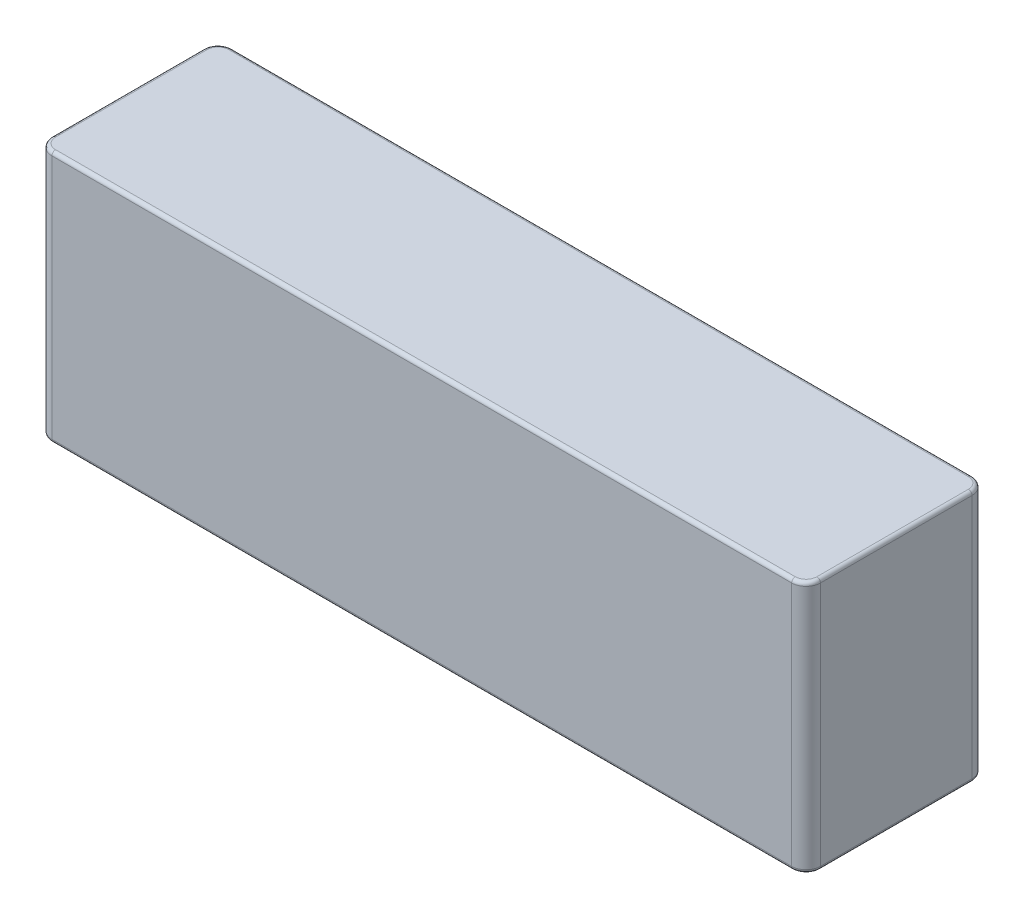
ISO-10303-21;
HEADER;
FILE_DESCRIPTION(('STEP AP214'),'2;1');
FILE_NAME('part.step','',(''),(''),'','','');
FILE_SCHEMA(('AUTOMOTIVE_DESIGN { 1 0 10303 214 1 1 1 1 }'));
ENDSEC;
DATA;
#1=APPLICATION_CONTEXT('core data for automotive mechanical design processes');
#2=APPLICATION_PROTOCOL_DEFINITION('international standard','automotive_design',2000,#1);
#3=PRODUCT_CONTEXT('',#1,'mechanical');
#4=PRODUCT('Part','Part','',(#3));
#5=PRODUCT_RELATED_PRODUCT_CATEGORY('part','',(#4));
#6=PRODUCT_DEFINITION_FORMATION('','',#4);
#7=PRODUCT_DEFINITION_CONTEXT('part definition',#1,'design');
#8=PRODUCT_DEFINITION('design','',#6,#7);
#9=PRODUCT_DEFINITION_SHAPE('','',#8);
#10=(LENGTH_UNIT() NAMED_UNIT(*) SI_UNIT(.MILLI.,.METRE.));
#11=(NAMED_UNIT(*) PLANE_ANGLE_UNIT() SI_UNIT($,.RADIAN.));
#12=(NAMED_UNIT(*) SI_UNIT($,.STERADIAN.) SOLID_ANGLE_UNIT());
#13=UNCERTAINTY_MEASURE_WITH_UNIT(LENGTH_MEASURE(1.E-05),#10,'distance_accuracy_value','');
#14=(GEOMETRIC_REPRESENTATION_CONTEXT(3) GLOBAL_UNCERTAINTY_ASSIGNED_CONTEXT((#13)) GLOBAL_UNIT_ASSIGNED_CONTEXT((#10,
#11,#12)) REPRESENTATION_CONTEXT('',''));
#15=CARTESIAN_POINT('',(0.,0.,0.));
#16=DIRECTION('',(0.,0.,1.));
#17=DIRECTION('',(1.,0.,0.));
#18=AXIS2_PLACEMENT_3D('',#15,#16,#17);
#19=CARTESIAN_POINT('',(53.25,17.5,25.));
#20=DIRECTION('',(-1.,0.,0.));
#21=DIRECTION('',(0.,0.,1.));
#22=AXIS2_PLACEMENT_3D('',#19,#20,#21);
#23=PLANE('',#22);
#24=DIRECTION('',(0.,1.,0.));
#25=VECTOR('',#24,1.);
#26=CARTESIAN_POINT('',(53.25,-17.5,23.));
#27=LINE('',#26,#25);
#28=CARTESIAN_POINT('',(53.25,17.,23.));
#29=VERTEX_POINT('',#28);
#30=CARTESIAN_POINT('',(53.25,-17.,23.));
#31=VERTEX_POINT('',#30);
#32=EDGE_CURVE('E207',#29,#31,#27,.F.);
#33=ORIENTED_EDGE('',*,*,#32,.T.);
#34=DIRECTION('',(0.,0.,-1.));
#35=VECTOR('',#34,1.);
#36=CARTESIAN_POINT('',(53.25,-17.,25.));
#37=LINE('',#36,#35);
#38=CARTESIAN_POINT('',(53.25,-17.,2.));
#39=VERTEX_POINT('',#38);
#40=EDGE_CURVE('E266',#31,#39,#37,.T.);
#41=ORIENTED_EDGE('',*,*,#40,.T.);
#42=DIRECTION('',(0.,1.,0.));
#43=VECTOR('',#42,1.);
#44=CARTESIAN_POINT('',(53.25,17.5,2.));
#45=LINE('',#44,#43);
#46=CARTESIAN_POINT('',(53.25,17.,2.));
#47=VERTEX_POINT('',#46);
#48=EDGE_CURVE('E212',#39,#47,#45,.T.);
#49=ORIENTED_EDGE('',*,*,#48,.T.);
#50=DIRECTION('',(0.,0.,-1.));
#51=VECTOR('',#50,1.);
#52=CARTESIAN_POINT('',(53.25,17.,25.));
#53=LINE('',#52,#51);
#54=EDGE_CURVE('E263',#47,#29,#53,.F.);
#55=ORIENTED_EDGE('',*,*,#54,.T.);
#56=EDGE_LOOP('',(#33,#41,#49,#55));
#57=FACE_BOUND('',#56,.T.);
#58=ADVANCED_FACE('F40',(#57),#23,.F.);
#59=CARTESIAN_POINT('',(-53.25,17.5,25.));
#60=DIRECTION('',(0.,-1.,0.));
#61=DIRECTION('',(0.,0.,-1.));
#62=AXIS2_PLACEMENT_3D('',#59,#60,#61);
#63=PLANE('',#62);
#64=DIRECTION('',(-1.,0.,0.));
#65=VECTOR('',#64,1.);
#66=CARTESIAN_POINT('',(51.25,17.5,24.5));
#67=LINE('',#66,#65);
#68=CARTESIAN_POINT('',(-51.25,17.5,24.5));
#69=VERTEX_POINT('',#68);
#70=CARTESIAN_POINT('',(51.25,17.5,24.5));
#71=VERTEX_POINT('',#70);
#72=EDGE_CURVE('E273',#69,#71,#67,.F.);
#73=ORIENTED_EDGE('',*,*,#72,.T.);
#74=CARTESIAN_POINT('',(51.25,17.5,23.));
#75=DIRECTION('',(0.,-1.,0.));
#76=DIRECTION('',(0.,0.,-1.));
#77=AXIS2_PLACEMENT_3D('',#74,#75,#76);
#78=CIRCLE('',#77,1.5);
#79=CARTESIAN_POINT('',(52.75,17.5,23.));
#80=VERTEX_POINT('',#79);
#81=EDGE_CURVE('E293',#71,#80,#78,.F.);
#82=ORIENTED_EDGE('',*,*,#81,.T.);
#83=DIRECTION('',(0.,0.,-1.));
#84=VECTOR('',#83,1.);
#85=CARTESIAN_POINT('',(52.75,17.5,25.));
#86=LINE('',#85,#84);
#87=CARTESIAN_POINT('',(52.75,17.5,2.));
#88=VERTEX_POINT('',#87);
#89=EDGE_CURVE('E68',#80,#88,#86,.T.);
#90=ORIENTED_EDGE('',*,*,#89,.T.);
#91=CARTESIAN_POINT('',(51.25,17.5,2.));
#92=DIRECTION('',(0.,-1.,0.));
#93=DIRECTION('',(0.,0.,-1.));
#94=AXIS2_PLACEMENT_3D('',#91,#92,#93);
#95=CIRCLE('',#94,1.5);
#96=CARTESIAN_POINT('',(51.25,17.5,0.5));
#97=VERTEX_POINT('',#96);
#98=EDGE_CURVE('E288',#88,#97,#95,.F.);
#99=ORIENTED_EDGE('',*,*,#98,.T.);
#100=DIRECTION('',(-1.,0.,0.));
#101=VECTOR('',#100,1.);
#102=CARTESIAN_POINT('',(-53.25,17.5,0.5));
#103=LINE('',#102,#101);
#104=CARTESIAN_POINT('',(-51.25,17.5,0.500000000000002));
#105=VERTEX_POINT('',#104);
#106=EDGE_CURVE('E285',#97,#105,#103,.T.);
#107=ORIENTED_EDGE('',*,*,#106,.T.);
#108=CARTESIAN_POINT('',(-51.25,17.5,2.));
#109=DIRECTION('',(0.,-1.,0.));
#110=DIRECTION('',(0.,0.,-1.));
#111=AXIS2_PLACEMENT_3D('',#108,#109,#110);
#112=CIRCLE('',#111,1.5);
#113=CARTESIAN_POINT('',(-52.75,17.5,2.));
#114=VERTEX_POINT('',#113);
#115=EDGE_CURVE('E282',#105,#114,#112,.F.);
#116=ORIENTED_EDGE('',*,*,#115,.T.);
#117=DIRECTION('',(0.,0.,-1.));
#118=VECTOR('',#117,1.);
#119=CARTESIAN_POINT('',(-52.75,17.5,25.));
#120=LINE('',#119,#118);
#121=CARTESIAN_POINT('',(-52.75,17.5,23.));
#122=VERTEX_POINT('',#121);
#123=EDGE_CURVE('E279',#114,#122,#120,.F.);
#124=ORIENTED_EDGE('',*,*,#123,.T.);
#125=CARTESIAN_POINT('',(-51.25,17.5,23.));
#126=DIRECTION('',(0.,-1.,0.));
#127=DIRECTION('',(0.,0.,-1.));
#128=AXIS2_PLACEMENT_3D('',#125,#126,#127);
#129=CIRCLE('',#128,1.5);
#130=EDGE_CURVE('E276',#122,#69,#129,.F.);
#131=ORIENTED_EDGE('',*,*,#130,.T.);
#132=EDGE_LOOP('',(#73,#82,#90,#99,#107,#116,#124,#131));
#133=FACE_BOUND('',#132,.T.);
#134=ADVANCED_FACE('F397',(#133),#63,.F.);
#135=CARTESIAN_POINT('',(-53.25,17.5,25.));
#136=DIRECTION('',(1.,0.,0.));
#137=DIRECTION('',(0.,1.,0.));
#138=AXIS2_PLACEMENT_3D('',#135,#136,#137);
#139=PLANE('',#138);
#140=DIRECTION('',(0.,-1.,0.));
#141=VECTOR('',#140,1.);
#142=CARTESIAN_POINT('',(-53.25,17.5,2.));
#143=LINE('',#142,#141);
#144=CARTESIAN_POINT('',(-53.25,17.,2.));
#145=VERTEX_POINT('',#144);
#146=CARTESIAN_POINT('',(-53.25,-17.,2.));
#147=VERTEX_POINT('',#146);
#148=EDGE_CURVE('E363',#145,#147,#143,.T.);
#149=ORIENTED_EDGE('',*,*,#148,.T.);
#150=DIRECTION('',(0.,0.,-1.));
#151=VECTOR('',#150,1.);
#152=CARTESIAN_POINT('',(-53.25,-17.,25.));
#153=LINE('',#152,#151);
#154=CARTESIAN_POINT('',(-53.25,-17.,23.));
#155=VERTEX_POINT('',#154);
#156=EDGE_CURVE('E242',#147,#155,#153,.F.);
#157=ORIENTED_EDGE('',*,*,#156,.T.);
#158=DIRECTION('',(0.,-1.,0.));
#159=VECTOR('',#158,1.);
#160=CARTESIAN_POINT('',(-53.25,17.5,23.));
#161=LINE('',#160,#159);
#162=CARTESIAN_POINT('',(-53.25,17.,23.));
#163=VERTEX_POINT('',#162);
#164=EDGE_CURVE('E318',#155,#163,#161,.F.);
#165=ORIENTED_EDGE('',*,*,#164,.T.);
#166=DIRECTION('',(0.,0.,-1.));
#167=VECTOR('',#166,1.);
#168=CARTESIAN_POINT('',(-53.25,17.,25.));
#169=LINE('',#168,#167);
#170=EDGE_CURVE('E239',#163,#145,#169,.T.);
#171=ORIENTED_EDGE('',*,*,#170,.T.);
#172=EDGE_LOOP('',(#149,#157,#165,#171));
#173=FACE_BOUND('',#172,.T.);
#174=ADVANCED_FACE('F453',(#173),#139,.F.);
#175=CARTESIAN_POINT('',(-53.25,-17.5,25.));
#176=DIRECTION('',(0.,1.,0.));
#177=DIRECTION('',(0.,0.,1.));
#178=AXIS2_PLACEMENT_3D('',#175,#176,#177);
#179=PLANE('',#178);
#180=DIRECTION('',(1.,0.,0.));
#181=VECTOR('',#180,1.);
#182=CARTESIAN_POINT('',(-51.25,-17.5,24.5));
#183=LINE('',#182,#181);
#184=CARTESIAN_POINT('',(51.25,-17.5,24.5));
#185=VERTEX_POINT('',#184);
#186=CARTESIAN_POINT('',(-51.25,-17.5,24.5));
#187=VERTEX_POINT('',#186);
#188=EDGE_CURVE('E185',#185,#187,#183,.F.);
#189=ORIENTED_EDGE('',*,*,#188,.T.);
#190=CARTESIAN_POINT('',(-51.25,-17.5,23.));
#191=DIRECTION('',(0.,1.,0.));
#192=DIRECTION('',(0.,0.,1.));
#193=AXIS2_PLACEMENT_3D('',#190,#191,#192);
#194=CIRCLE('',#193,1.5);
#195=CARTESIAN_POINT('',(-52.75,-17.5,23.));
#196=VERTEX_POINT('',#195);
#197=EDGE_CURVE('E230',#187,#196,#194,.F.);
#198=ORIENTED_EDGE('',*,*,#197,.T.);
#199=DIRECTION('',(0.,0.,-1.));
#200=VECTOR('',#199,1.);
#201=CARTESIAN_POINT('',(-52.75,-17.5,25.));
#202=LINE('',#201,#200);
#203=CARTESIAN_POINT('',(-52.75,-17.5,2.));
#204=VERTEX_POINT('',#203);
#205=EDGE_CURVE('E227',#196,#204,#202,.T.);
#206=ORIENTED_EDGE('',*,*,#205,.T.);
#207=CARTESIAN_POINT('',(-51.25,-17.5,2.));
#208=DIRECTION('',(0.,1.,0.));
#209=DIRECTION('',(0.,0.,1.));
#210=AXIS2_PLACEMENT_3D('',#207,#208,#209);
#211=CIRCLE('',#210,1.5);
#212=CARTESIAN_POINT('',(-51.25,-17.5,0.5));
#213=VERTEX_POINT('',#212);
#214=EDGE_CURVE('E224',#204,#213,#211,.F.);
#215=ORIENTED_EDGE('',*,*,#214,.T.);
#216=DIRECTION('',(1.,0.,0.));
#217=VECTOR('',#216,1.);
#218=CARTESIAN_POINT('',(-53.25,-17.5,0.5));
#219=LINE('',#218,#217);
#220=CARTESIAN_POINT('',(51.25,-17.5,0.500000000000002));
#221=VERTEX_POINT('',#220);
#222=EDGE_CURVE('E221',#213,#221,#219,.T.);
#223=ORIENTED_EDGE('',*,*,#222,.T.);
#224=CARTESIAN_POINT('',(51.25,-17.5,2.));
#225=DIRECTION('',(0.,1.,0.));
#226=DIRECTION('',(0.,0.,1.));
#227=AXIS2_PLACEMENT_3D('',#224,#225,#226);
#228=CIRCLE('',#227,1.5);
#229=CARTESIAN_POINT('',(52.75,-17.5,2.));
#230=VERTEX_POINT('',#229);
#231=EDGE_CURVE('E218',#221,#230,#228,.F.);
#232=ORIENTED_EDGE('',*,*,#231,.T.);
#233=DIRECTION('',(0.,0.,-1.));
#234=VECTOR('',#233,1.);
#235=CARTESIAN_POINT('',(52.75,-17.5,25.));
#236=LINE('',#235,#234);
#237=CARTESIAN_POINT('',(52.75,-17.5,23.));
#238=VERTEX_POINT('',#237);
#239=EDGE_CURVE('E188',#230,#238,#236,.F.);
#240=ORIENTED_EDGE('',*,*,#239,.T.);
#241=CARTESIAN_POINT('',(51.25,-17.5,23.));
#242=DIRECTION('',(0.,1.,0.));
#243=DIRECTION('',(0.,0.,1.));
#244=AXIS2_PLACEMENT_3D('',#241,#242,#243);
#245=CIRCLE('',#244,1.5);
#246=EDGE_CURVE('E180',#238,#185,#245,.F.);
#247=ORIENTED_EDGE('',*,*,#246,.T.);
#248=EDGE_LOOP('',(#189,#198,#206,#215,#223,#232,#240,#247));
#249=FACE_BOUND('',#248,.T.);
#250=ADVANCED_FACE('F182',(#249),#179,.F.);
#251=CARTESIAN_POINT('',(0.,0.,25.));
#252=DIRECTION('',(0.,0.,1.));
#253=DIRECTION('',(1.,0.,0.));
#254=AXIS2_PLACEMENT_3D('',#251,#252,#253);
#255=PLANE('',#254);
#256=DIRECTION('',(0.,-1.,0.));
#257=VECTOR('',#256,1.);
#258=CARTESIAN_POINT('',(-51.25,-17.5,25.));
#259=LINE('',#258,#257);
#260=CARTESIAN_POINT('',(-51.25,17.,25.));
#261=VERTEX_POINT('',#260);
#262=CARTESIAN_POINT('',(-51.25,-17.,25.));
#263=VERTEX_POINT('',#262);
#264=EDGE_CURVE('E374',#261,#263,#259,.T.);
#265=ORIENTED_EDGE('',*,*,#264,.T.);
#266=DIRECTION('',(1.,0.,0.));
#267=VECTOR('',#266,1.);
#268=CARTESIAN_POINT('',(51.25,-17.,25.));
#269=LINE('',#268,#267);
#270=CARTESIAN_POINT('',(51.25,-17.,25.));
#271=VERTEX_POINT('',#270);
#272=EDGE_CURVE('E11',#263,#271,#269,.T.);
#273=ORIENTED_EDGE('',*,*,#272,.T.);
#274=DIRECTION('',(0.,1.,0.));
#275=VECTOR('',#274,1.);
#276=CARTESIAN_POINT('',(51.25,17.5,25.));
#277=LINE('',#276,#275);
#278=CARTESIAN_POINT('',(51.25,17.,25.));
#279=VERTEX_POINT('',#278);
#280=EDGE_CURVE('E370',#271,#279,#277,.T.);
#281=ORIENTED_EDGE('',*,*,#280,.T.);
#282=DIRECTION('',(-1.,0.,0.));
#283=VECTOR('',#282,1.);
#284=CARTESIAN_POINT('',(-51.25,17.,25.));
#285=LINE('',#284,#283);
#286=EDGE_CURVE('E50',#279,#261,#285,.T.);
#287=ORIENTED_EDGE('',*,*,#286,.T.);
#288=EDGE_LOOP('',(#265,#273,#281,#287));
#289=FACE_BOUND('',#288,.T.);
#290=ADVANCED_FACE('F410',(#289),#255,.T.);
#291=CARTESIAN_POINT('',(0.,0.,0.));
#292=DIRECTION('',(0.,0.,1.));
#293=DIRECTION('',(1.,0.,0.));
#294=AXIS2_PLACEMENT_3D('',#291,#292,#293);
#295=PLANE('',#294);
#296=DIRECTION('',(0.,1.,0.));
#297=VECTOR('',#296,1.);
#298=CARTESIAN_POINT('',(51.25,0.,0.));
#299=LINE('',#298,#297);
#300=CARTESIAN_POINT('',(51.25,17.,0.));
#301=VERTEX_POINT('',#300);
#302=CARTESIAN_POINT('',(51.25,-17.,0.));
#303=VERTEX_POINT('',#302);
#304=EDGE_CURVE('E371',#301,#303,#299,.F.);
#305=ORIENTED_EDGE('',*,*,#304,.T.);
#306=DIRECTION('',(1.,0.,0.));
#307=VECTOR('',#306,1.);
#308=CARTESIAN_POINT('',(0.,-17.,0.));
#309=LINE('',#308,#307);
#310=CARTESIAN_POINT('',(-51.25,-17.,0.));
#311=VERTEX_POINT('',#310);
#312=EDGE_CURVE('E254',#303,#311,#309,.F.);
#313=ORIENTED_EDGE('',*,*,#312,.T.);
#314=DIRECTION('',(0.,-1.,0.));
#315=VECTOR('',#314,1.);
#316=CARTESIAN_POINT('',(-51.25,0.,0.));
#317=LINE('',#316,#315);
#318=CARTESIAN_POINT('',(-51.25,17.,0.));
#319=VERTEX_POINT('',#318);
#320=EDGE_CURVE('E360',#311,#319,#317,.F.);
#321=ORIENTED_EDGE('',*,*,#320,.T.);
#322=DIRECTION('',(-1.,0.,0.));
#323=VECTOR('',#322,1.);
#324=CARTESIAN_POINT('',(0.,17.,0.));
#325=LINE('',#324,#323);
#326=EDGE_CURVE('E251',#319,#301,#325,.F.);
#327=ORIENTED_EDGE('',*,*,#326,.T.);
#328=EDGE_LOOP('',(#305,#313,#321,#327));
#329=FACE_BOUND('',#328,.T.);
#330=ADVANCED_FACE('F366',(#329),#295,.F.);
#331=CARTESIAN_POINT('',(-51.25,17.5,2.));
#332=DIRECTION('',(0.,-1.,0.));
#333=DIRECTION('',(1.,0.,0.));
#334=AXIS2_PLACEMENT_3D('',#331,#332,#333);
#335=CYLINDRICAL_SURFACE('',#334,2.);
#336=ORIENTED_EDGE('',*,*,#320,.F.);
#337=CARTESIAN_POINT('',(-51.25,-17.,2.));
#338=DIRECTION('',(0.,1.,0.));
#339=DIRECTION('',(0.,0.,1.));
#340=AXIS2_PLACEMENT_3D('',#337,#338,#339);
#341=CIRCLE('',#340,2.);
#342=EDGE_CURVE('E248',#311,#147,#341,.T.);
#343=ORIENTED_EDGE('',*,*,#342,.T.);
#344=ORIENTED_EDGE('',*,*,#148,.F.);
#345=CARTESIAN_POINT('',(-51.25,17.,2.));
#346=DIRECTION('',(0.,-1.,0.));
#347=DIRECTION('',(0.,0.,-1.));
#348=AXIS2_PLACEMENT_3D('',#345,#346,#347);
#349=CIRCLE('',#348,2.);
#350=EDGE_CURVE('E245',#145,#319,#349,.T.);
#351=ORIENTED_EDGE('',*,*,#350,.T.);
#352=EDGE_LOOP('',(#336,#343,#344,#351));
#353=FACE_BOUND('',#352,.T.);
#354=ADVANCED_FACE('F359',(#353),#335,.T.);
#355=CARTESIAN_POINT('',(-51.25,0.,23.));
#356=DIRECTION('',(0.,1.,0.));
#357=DIRECTION('',(-1.,0.,0.));
#358=AXIS2_PLACEMENT_3D('',#355,#356,#357);
#359=CYLINDRICAL_SURFACE('',#358,2.);
#360=ORIENTED_EDGE('',*,*,#164,.F.);
#361=CARTESIAN_POINT('',(-51.25,-17.,23.));
#362=DIRECTION('',(0.,1.,0.));
#363=DIRECTION('',(0.,0.,1.));
#364=AXIS2_PLACEMENT_3D('',#361,#362,#363);
#365=CIRCLE('',#364,2.);
#366=EDGE_CURVE('E235',#155,#263,#365,.T.);
#367=ORIENTED_EDGE('',*,*,#366,.T.);
#368=ORIENTED_EDGE('',*,*,#264,.F.);
#369=CARTESIAN_POINT('',(-51.25,17.,23.));
#370=DIRECTION('',(0.,-1.,0.));
#371=DIRECTION('',(0.,0.,-1.));
#372=AXIS2_PLACEMENT_3D('',#369,#370,#371);
#373=CIRCLE('',#372,2.);
#374=EDGE_CURVE('E232',#261,#163,#373,.T.);
#375=ORIENTED_EDGE('',*,*,#374,.T.);
#376=EDGE_LOOP('',(#360,#367,#368,#375));
#377=FACE_BOUND('',#376,.T.);
#378=ADVANCED_FACE('F414',(#377),#359,.T.);
#379=CARTESIAN_POINT('',(51.25,0.,23.));
#380=DIRECTION('',(0.,-1.,0.));
#381=DIRECTION('',(0.,0.,-1.));
#382=AXIS2_PLACEMENT_3D('',#379,#380,#381);
#383=CYLINDRICAL_SURFACE('',#382,2.);
#384=ORIENTED_EDGE('',*,*,#280,.F.);
#385=CARTESIAN_POINT('',(51.25,-17.,23.));
#386=DIRECTION('',(0.,1.,0.));
#387=DIRECTION('',(0.,0.,1.));
#388=AXIS2_PLACEMENT_3D('',#385,#386,#387);
#389=CIRCLE('',#388,2.);
#390=EDGE_CURVE('E197',#271,#31,#389,.T.);
#391=ORIENTED_EDGE('',*,*,#390,.T.);
#392=ORIENTED_EDGE('',*,*,#32,.F.);
#393=CARTESIAN_POINT('',(51.25,17.,23.));
#394=DIRECTION('',(0.,-1.,0.));
#395=DIRECTION('',(0.,0.,-1.));
#396=AXIS2_PLACEMENT_3D('',#393,#394,#395);
#397=CIRCLE('',#396,2.);
#398=EDGE_CURVE('E269',#29,#279,#397,.T.);
#399=ORIENTED_EDGE('',*,*,#398,.T.);
#400=EDGE_LOOP('',(#384,#391,#392,#399));
#401=FACE_BOUND('',#400,.T.);
#402=ADVANCED_FACE('F409',(#401),#383,.T.);
#403=CARTESIAN_POINT('',(51.25,17.5,2.));
#404=DIRECTION('',(0.,1.,0.));
#405=DIRECTION('',(0.,0.,1.));
#406=AXIS2_PLACEMENT_3D('',#403,#404,#405);
#407=CYLINDRICAL_SURFACE('',#406,2.);
#408=ORIENTED_EDGE('',*,*,#48,.F.);
#409=CARTESIAN_POINT('',(51.25,-17.,2.));
#410=DIRECTION('',(0.,1.,0.));
#411=DIRECTION('',(0.,0.,1.));
#412=AXIS2_PLACEMENT_3D('',#409,#410,#411);
#413=CIRCLE('',#412,2.);
#414=EDGE_CURVE('E260',#39,#303,#413,.T.);
#415=ORIENTED_EDGE('',*,*,#414,.T.);
#416=ORIENTED_EDGE('',*,*,#304,.F.);
#417=CARTESIAN_POINT('',(51.25,17.,2.));
#418=DIRECTION('',(0.,-1.,0.));
#419=DIRECTION('',(0.,0.,-1.));
#420=AXIS2_PLACEMENT_3D('',#417,#418,#419);
#421=CIRCLE('',#420,2.);
#422=EDGE_CURVE('E257',#301,#47,#421,.T.);
#423=ORIENTED_EDGE('',*,*,#422,.T.);
#424=EDGE_LOOP('',(#408,#415,#416,#423));
#425=FACE_BOUND('',#424,.T.);
#426=ADVANCED_FACE('F446',(#425),#407,.T.);
#427=CARTESIAN_POINT('',(51.25,-17.,2.));
#428=DIRECTION('',(0.,1.,0.));
#429=DIRECTION('',(0.,0.,1.));
#430=AXIS2_PLACEMENT_3D('',#427,#428,#429);
#431=TOROIDAL_SURFACE('',#430,1.5,0.5);
#432=CARTESIAN_POINT('',(51.25,-17.,0.500000000000002));
#433=DIRECTION('',(-1.,0.,0.));
#434=DIRECTION('',(0.,0.,1.));
#435=AXIS2_PLACEMENT_3D('',#432,#433,#434);
#436=CIRCLE('',#435,0.5);
#437=EDGE_CURVE('E310',#303,#221,#436,.T.);
#438=ORIENTED_EDGE('',*,*,#437,.F.);
#439=ORIENTED_EDGE('',*,*,#414,.F.);
#440=CARTESIAN_POINT('',(52.75,-17.,2.));
#441=DIRECTION('',(0.,0.,1.));
#442=DIRECTION('',(1.,0.,0.));
#443=AXIS2_PLACEMENT_3D('',#440,#441,#442);
#444=CIRCLE('',#443,0.5);
#445=EDGE_CURVE('E314',#230,#39,#444,.T.);
#446=ORIENTED_EDGE('',*,*,#445,.F.);
#447=ORIENTED_EDGE('',*,*,#231,.F.);
#448=EDGE_LOOP('',(#438,#439,#446,#447));
#449=FACE_BOUND('',#448,.T.);
#450=ADVANCED_FACE('F436',(#449),#431,.T.);
#451=CARTESIAN_POINT('',(52.75,-17.,25.));
#452=DIRECTION('',(0.,0.,-1.));
#453=DIRECTION('',(-1.,0.,0.));
#454=AXIS2_PLACEMENT_3D('',#451,#452,#453);
#455=CYLINDRICAL_SURFACE('',#454,0.5);
#456=ORIENTED_EDGE('',*,*,#445,.T.);
#457=ORIENTED_EDGE('',*,*,#40,.F.);
#458=CARTESIAN_POINT('',(52.75,-17.,23.));
#459=DIRECTION('',(0.,0.,1.));
#460=DIRECTION('',(1.,0.,0.));
#461=AXIS2_PLACEMENT_3D('',#458,#459,#460);
#462=CIRCLE('',#461,0.5);
#463=EDGE_CURVE('E308',#238,#31,#462,.T.);
#464=ORIENTED_EDGE('',*,*,#463,.F.);
#465=ORIENTED_EDGE('',*,*,#239,.F.);
#466=EDGE_LOOP('',(#456,#457,#464,#465));
#467=FACE_BOUND('',#466,.T.);
#468=ADVANCED_FACE('F438',(#467),#455,.T.);
#469=CARTESIAN_POINT('',(-53.25,-17.,0.5));
#470=DIRECTION('',(1.,0.,0.));
#471=DIRECTION('',(0.,0.,-1.));
#472=AXIS2_PLACEMENT_3D('',#469,#470,#471);
#473=CYLINDRICAL_SURFACE('',#472,0.5);
#474=ORIENTED_EDGE('',*,*,#437,.T.);
#475=ORIENTED_EDGE('',*,*,#222,.F.);
#476=CARTESIAN_POINT('',(-51.25,-17.,0.5));
#477=DIRECTION('',(-1.,0.,0.));
#478=DIRECTION('',(0.,0.,1.));
#479=AXIS2_PLACEMENT_3D('',#476,#477,#478);
#480=CIRCLE('',#479,0.5);
#481=EDGE_CURVE('E200',#311,#213,#480,.T.);
#482=ORIENTED_EDGE('',*,*,#481,.F.);
#483=ORIENTED_EDGE('',*,*,#312,.F.);
#484=EDGE_LOOP('',(#474,#475,#482,#483));
#485=FACE_BOUND('',#484,.T.);
#486=ADVANCED_FACE('F431',(#485),#473,.T.);
#487=CARTESIAN_POINT('',(51.25,-17.,23.));
#488=DIRECTION('',(0.,1.,0.));
#489=DIRECTION('',(0.,0.,1.));
#490=AXIS2_PLACEMENT_3D('',#487,#488,#489);
#491=TOROIDAL_SURFACE('',#490,1.5,0.5);
#492=ORIENTED_EDGE('',*,*,#463,.T.);
#493=ORIENTED_EDGE('',*,*,#390,.F.);
#494=CARTESIAN_POINT('',(51.25,-17.,24.5));
#495=DIRECTION('',(-1.,0.,0.));
#496=DIRECTION('',(0.,0.,1.));
#497=AXIS2_PLACEMENT_3D('',#494,#495,#496);
#498=CIRCLE('',#497,0.5);
#499=EDGE_CURVE('E195',#185,#271,#498,.T.);
#500=ORIENTED_EDGE('',*,*,#499,.F.);
#501=ORIENTED_EDGE('',*,*,#246,.F.);
#502=EDGE_LOOP('',(#492,#493,#500,#501));
#503=FACE_BOUND('',#502,.T.);
#504=ADVANCED_FACE('F196',(#503),#491,.T.);
#505=CARTESIAN_POINT('',(-51.25,-17.,2.));
#506=DIRECTION('',(0.,1.,0.));
#507=DIRECTION('',(0.,0.,1.));
#508=AXIS2_PLACEMENT_3D('',#505,#506,#507);
#509=TOROIDAL_SURFACE('',#508,1.5,0.5);
#510=ORIENTED_EDGE('',*,*,#481,.T.);
#511=ORIENTED_EDGE('',*,*,#214,.F.);
#512=CARTESIAN_POINT('',(-52.75,-17.,2.));
#513=DIRECTION('',(0.,0.,1.));
#514=DIRECTION('',(1.,0.,0.));
#515=AXIS2_PLACEMENT_3D('',#512,#513,#514);
#516=CIRCLE('',#515,0.5);
#517=EDGE_CURVE('E201',#147,#204,#516,.T.);
#518=ORIENTED_EDGE('',*,*,#517,.F.);
#519=ORIENTED_EDGE('',*,*,#342,.F.);
#520=EDGE_LOOP('',(#510,#511,#518,#519));
#521=FACE_BOUND('',#520,.T.);
#522=ADVANCED_FACE('F428',(#521),#509,.T.);
#523=CARTESIAN_POINT('',(0.,-17.,24.5));
#524=DIRECTION('',(-1.,0.,0.));
#525=DIRECTION('',(0.,0.,1.));
#526=AXIS2_PLACEMENT_3D('',#523,#524,#525);
#527=CYLINDRICAL_SURFACE('',#526,0.5);
#528=ORIENTED_EDGE('',*,*,#499,.T.);
#529=ORIENTED_EDGE('',*,*,#272,.F.);
#530=CARTESIAN_POINT('',(-51.25,-17.,24.5));
#531=DIRECTION('',(-1.,0.,0.));
#532=DIRECTION('',(0.,0.,1.));
#533=AXIS2_PLACEMENT_3D('',#530,#531,#532);
#534=CIRCLE('',#533,0.5);
#535=EDGE_CURVE('E204',#187,#263,#534,.T.);
#536=ORIENTED_EDGE('',*,*,#535,.F.);
#537=ORIENTED_EDGE('',*,*,#188,.F.);
#538=EDGE_LOOP('',(#528,#529,#536,#537));
#539=FACE_BOUND('',#538,.T.);
#540=ADVANCED_FACE('F203',(#539),#527,.T.);
#541=CARTESIAN_POINT('',(-52.75,-17.,25.));
#542=DIRECTION('',(0.,0.,-1.));
#543=DIRECTION('',(-1.,0.,0.));
#544=AXIS2_PLACEMENT_3D('',#541,#542,#543);
#545=CYLINDRICAL_SURFACE('',#544,0.5);
#546=ORIENTED_EDGE('',*,*,#517,.T.);
#547=ORIENTED_EDGE('',*,*,#205,.F.);
#548=CARTESIAN_POINT('',(-52.75,-17.,23.));
#549=DIRECTION('',(0.,0.,1.));
#550=DIRECTION('',(1.,0.,0.));
#551=AXIS2_PLACEMENT_3D('',#548,#549,#550);
#552=CIRCLE('',#551,0.5);
#553=EDGE_CURVE('E297',#155,#196,#552,.T.);
#554=ORIENTED_EDGE('',*,*,#553,.F.);
#555=ORIENTED_EDGE('',*,*,#156,.F.);
#556=EDGE_LOOP('',(#546,#547,#554,#555));
#557=FACE_BOUND('',#556,.T.);
#558=ADVANCED_FACE('F423',(#557),#545,.T.);
#559=CARTESIAN_POINT('',(-51.25,-17.,23.));
#560=DIRECTION('',(0.,1.,0.));
#561=DIRECTION('',(0.,0.,1.));
#562=AXIS2_PLACEMENT_3D('',#559,#560,#561);
#563=TOROIDAL_SURFACE('',#562,1.5,0.5);
#564=ORIENTED_EDGE('',*,*,#535,.T.);
#565=ORIENTED_EDGE('',*,*,#366,.F.);
#566=ORIENTED_EDGE('',*,*,#553,.T.);
#567=ORIENTED_EDGE('',*,*,#197,.F.);
#568=EDGE_LOOP('',(#564,#565,#566,#567));
#569=FACE_BOUND('',#568,.T.);
#570=ADVANCED_FACE('F419',(#569),#563,.T.);
#571=CARTESIAN_POINT('',(-51.25,17.,2.));
#572=DIRECTION('',(0.,-1.,0.));
#573=DIRECTION('',(0.,0.,-1.));
#574=AXIS2_PLACEMENT_3D('',#571,#572,#573);
#575=TOROIDAL_SURFACE('',#574,1.5,0.5);
#576=CARTESIAN_POINT('',(-51.25,17.,0.500000000000002));
#577=DIRECTION('',(1.,0.,0.));
#578=DIRECTION('',(0.,0.,-1.));
#579=AXIS2_PLACEMENT_3D('',#576,#577,#578);
#580=CIRCLE('',#579,0.5);
#581=EDGE_CURVE('E337',#319,#105,#580,.T.);
#582=ORIENTED_EDGE('',*,*,#581,.F.);
#583=ORIENTED_EDGE('',*,*,#350,.F.);
#584=CARTESIAN_POINT('',(-52.75,17.,2.));
#585=DIRECTION('',(0.,0.,1.));
#586=DIRECTION('',(1.,0.,0.));
#587=AXIS2_PLACEMENT_3D('',#584,#585,#586);
#588=CIRCLE('',#587,0.5);
#589=EDGE_CURVE('E44',#114,#145,#588,.T.);
#590=ORIENTED_EDGE('',*,*,#589,.F.);
#591=ORIENTED_EDGE('',*,*,#115,.F.);
#592=EDGE_LOOP('',(#582,#583,#590,#591));
#593=FACE_BOUND('',#592,.T.);
#594=ADVANCED_FACE('F42',(#593),#575,.T.);
#595=CARTESIAN_POINT('',(-52.75,17.,25.));
#596=DIRECTION('',(0.,0.,-1.));
#597=DIRECTION('',(-1.,0.,0.));
#598=AXIS2_PLACEMENT_3D('',#595,#596,#597);
#599=CYLINDRICAL_SURFACE('',#598,0.5);
#600=ORIENTED_EDGE('',*,*,#589,.T.);
#601=ORIENTED_EDGE('',*,*,#170,.F.);
#602=CARTESIAN_POINT('',(-52.75,17.,23.));
#603=DIRECTION('',(0.,0.,1.));
#604=DIRECTION('',(1.,0.,0.));
#605=AXIS2_PLACEMENT_3D('',#602,#603,#604);
#606=CIRCLE('',#605,0.5);
#607=EDGE_CURVE('E334',#122,#163,#606,.T.);
#608=ORIENTED_EDGE('',*,*,#607,.F.);
#609=ORIENTED_EDGE('',*,*,#123,.F.);
#610=EDGE_LOOP('',(#600,#601,#608,#609));
#611=FACE_BOUND('',#610,.T.);
#612=ADVANCED_FACE('F350',(#611),#599,.T.);
#613=CARTESIAN_POINT('',(-53.25,17.,0.5));
#614=DIRECTION('',(-1.,0.,0.));
#615=DIRECTION('',(0.,0.,1.));
#616=AXIS2_PLACEMENT_3D('',#613,#614,#615);
#617=CYLINDRICAL_SURFACE('',#616,0.5);
#618=ORIENTED_EDGE('',*,*,#581,.T.);
#619=ORIENTED_EDGE('',*,*,#106,.F.);
#620=CARTESIAN_POINT('',(51.25,17.,0.5));
#621=DIRECTION('',(1.,0.,0.));
#622=DIRECTION('',(0.,0.,-1.));
#623=AXIS2_PLACEMENT_3D('',#620,#621,#622);
#624=CIRCLE('',#623,0.5);
#625=EDGE_CURVE('E330',#301,#97,#624,.T.);
#626=ORIENTED_EDGE('',*,*,#625,.F.);
#627=ORIENTED_EDGE('',*,*,#326,.F.);
#628=EDGE_LOOP('',(#618,#619,#626,#627));
#629=FACE_BOUND('',#628,.T.);
#630=ADVANCED_FACE('F506',(#629),#617,.T.);
#631=CARTESIAN_POINT('',(-51.25,17.,23.));
#632=DIRECTION('',(0.,-1.,0.));
#633=DIRECTION('',(0.,0.,-1.));
#634=AXIS2_PLACEMENT_3D('',#631,#632,#633);
#635=TOROIDAL_SURFACE('',#634,1.5,0.5);
#636=ORIENTED_EDGE('',*,*,#607,.T.);
#637=ORIENTED_EDGE('',*,*,#374,.F.);
#638=CARTESIAN_POINT('',(-51.25,17.,24.5));
#639=DIRECTION('',(1.,0.,0.));
#640=DIRECTION('',(0.,0.,-1.));
#641=AXIS2_PLACEMENT_3D('',#638,#639,#640);
#642=CIRCLE('',#641,0.5);
#643=EDGE_CURVE('E326',#69,#261,#642,.T.);
#644=ORIENTED_EDGE('',*,*,#643,.F.);
#645=ORIENTED_EDGE('',*,*,#130,.F.);
#646=EDGE_LOOP('',(#636,#637,#644,#645));
#647=FACE_BOUND('',#646,.T.);
#648=ADVANCED_FACE('F513',(#647),#635,.T.);
#649=CARTESIAN_POINT('',(51.25,17.,2.));
#650=DIRECTION('',(0.,-1.,0.));
#651=DIRECTION('',(0.,0.,-1.));
#652=AXIS2_PLACEMENT_3D('',#649,#650,#651);
#653=TOROIDAL_SURFACE('',#652,1.5,0.5);
#654=ORIENTED_EDGE('',*,*,#625,.T.);
#655=ORIENTED_EDGE('',*,*,#98,.F.);
#656=CARTESIAN_POINT('',(52.75,17.,2.));
#657=DIRECTION('',(0.,0.,1.));
#658=DIRECTION('',(1.,0.,0.));
#659=AXIS2_PLACEMENT_3D('',#656,#657,#658);
#660=CIRCLE('',#659,0.5);
#661=EDGE_CURVE('E322',#47,#88,#660,.T.);
#662=ORIENTED_EDGE('',*,*,#661,.F.);
#663=ORIENTED_EDGE('',*,*,#422,.F.);
#664=EDGE_LOOP('',(#654,#655,#662,#663));
#665=FACE_BOUND('',#664,.T.);
#666=ADVANCED_FACE('F394',(#665),#653,.T.);
#667=CARTESIAN_POINT('',(0.,17.,24.5));
#668=DIRECTION('',(1.,0.,0.));
#669=DIRECTION('',(0.,0.,-1.));
#670=AXIS2_PLACEMENT_3D('',#667,#668,#669);
#671=CYLINDRICAL_SURFACE('',#670,0.5);
#672=ORIENTED_EDGE('',*,*,#643,.T.);
#673=ORIENTED_EDGE('',*,*,#286,.F.);
#674=CARTESIAN_POINT('',(51.25,17.,24.5));
#675=DIRECTION('',(1.,0.,0.));
#676=DIRECTION('',(0.,0.,-1.));
#677=AXIS2_PLACEMENT_3D('',#674,#675,#676);
#678=CIRCLE('',#677,0.5);
#679=EDGE_CURVE('E320',#71,#279,#678,.T.);
#680=ORIENTED_EDGE('',*,*,#679,.F.);
#681=ORIENTED_EDGE('',*,*,#72,.F.);
#682=EDGE_LOOP('',(#672,#673,#680,#681));
#683=FACE_BOUND('',#682,.T.);
#684=ADVANCED_FACE('F403',(#683),#671,.T.);
#685=CARTESIAN_POINT('',(52.75,17.,25.));
#686=DIRECTION('',(0.,0.,-1.));
#687=DIRECTION('',(-1.,0.,0.));
#688=AXIS2_PLACEMENT_3D('',#685,#686,#687);
#689=CYLINDRICAL_SURFACE('',#688,0.5);
#690=ORIENTED_EDGE('',*,*,#661,.T.);
#691=ORIENTED_EDGE('',*,*,#89,.F.);
#692=CARTESIAN_POINT('',(52.75,17.,23.));
#693=DIRECTION('',(0.,0.,1.));
#694=DIRECTION('',(1.,0.,0.));
#695=AXIS2_PLACEMENT_3D('',#692,#693,#694);
#696=CIRCLE('',#695,0.5);
#697=EDGE_CURVE('E58',#29,#80,#696,.T.);
#698=ORIENTED_EDGE('',*,*,#697,.F.);
#699=ORIENTED_EDGE('',*,*,#54,.F.);
#700=EDGE_LOOP('',(#690,#691,#698,#699));
#701=FACE_BOUND('',#700,.T.);
#702=ADVANCED_FACE('F396',(#701),#689,.T.);
#703=CARTESIAN_POINT('',(51.25,17.,23.));
#704=DIRECTION('',(0.,-1.,0.));
#705=DIRECTION('',(0.,0.,-1.));
#706=AXIS2_PLACEMENT_3D('',#703,#704,#705);
#707=TOROIDAL_SURFACE('',#706,1.5,0.5);
#708=ORIENTED_EDGE('',*,*,#679,.T.);
#709=ORIENTED_EDGE('',*,*,#398,.F.);
#710=ORIENTED_EDGE('',*,*,#697,.T.);
#711=ORIENTED_EDGE('',*,*,#81,.F.);
#712=EDGE_LOOP('',(#708,#709,#710,#711));
#713=FACE_BOUND('',#712,.T.);
#714=ADVANCED_FACE('F400',(#713),#707,.T.);
#715=CLOSED_SHELL('',(#58,#134,#174,#250,#290,#330,#354,#378,#402,#426,#450,#468,#486,#504,#522,
#540,#558,#570,#594,#612,#630,#648,#666,#684,#702,#714));
#716=MANIFOLD_SOLID_BREP('B2',#715);
#717=ADVANCED_BREP_SHAPE_REPRESENTATION('',(#18,#716),#14);
#718=SHAPE_DEFINITION_REPRESENTATION(#9,#717);
ENDSEC;
END-ISO-10303-21;
